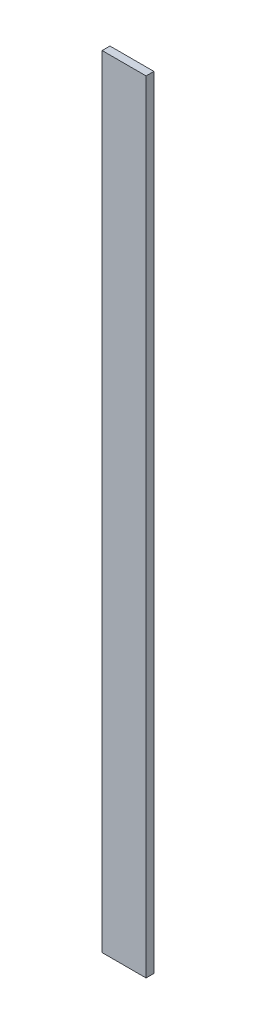
ISO-10303-21;
HEADER;
FILE_DESCRIPTION(('STEP AP214'),'2;1');
FILE_NAME('part.step','',(''),(''),'','','');
FILE_SCHEMA(('AUTOMOTIVE_DESIGN { 1 0 10303 214 1 1 1 1 }'));
ENDSEC;
DATA;
#1=APPLICATION_CONTEXT('core data for automotive mechanical design processes');
#2=APPLICATION_PROTOCOL_DEFINITION('international standard','automotive_design',2000,#1);
#3=PRODUCT_CONTEXT('',#1,'mechanical');
#4=PRODUCT('Part','Part','',(#3));
#5=PRODUCT_RELATED_PRODUCT_CATEGORY('part','',(#4));
#6=PRODUCT_DEFINITION_FORMATION('','',#4);
#7=PRODUCT_DEFINITION_CONTEXT('part definition',#1,'design');
#8=PRODUCT_DEFINITION('design','',#6,#7);
#9=PRODUCT_DEFINITION_SHAPE('','',#8);
#10=(LENGTH_UNIT() NAMED_UNIT(*) SI_UNIT(.MILLI.,.METRE.));
#11=(NAMED_UNIT(*) PLANE_ANGLE_UNIT() SI_UNIT($,.RADIAN.));
#12=(NAMED_UNIT(*) SI_UNIT($,.STERADIAN.) SOLID_ANGLE_UNIT());
#13=UNCERTAINTY_MEASURE_WITH_UNIT(LENGTH_MEASURE(1.E-05),#10,'distance_accuracy_value','');
#14=(GEOMETRIC_REPRESENTATION_CONTEXT(3) GLOBAL_UNCERTAINTY_ASSIGNED_CONTEXT((#13)) GLOBAL_UNIT_ASSIGNED_CONTEXT((#10,
#11,#12)) REPRESENTATION_CONTEXT('',''));
#15=CARTESIAN_POINT('',(0.,0.,0.));
#16=DIRECTION('',(0.,0.,1.));
#17=DIRECTION('',(1.,0.,0.));
#18=AXIS2_PLACEMENT_3D('',#15,#16,#17);
#19=CARTESIAN_POINT('',(-7.14375000000001,168.827893900614,2.54));
#20=DIRECTION('',(1.,0.,0.));
#21=DIRECTION('',(0.,1.,0.));
#22=AXIS2_PLACEMENT_3D('',#19,#20,#21);
#23=PLANE('',#22);
#24=DIRECTION('',(0.,-1.,0.));
#25=VECTOR('',#24,1.);
#26=CARTESIAN_POINT('',(-7.14375000000001,168.827893900614,0.));
#27=LINE('',#26,#25);
#28=CARTESIAN_POINT('',(-7.14375000000001,168.827893900614,0.));
#29=VERTEX_POINT('',#28);
#30=CARTESIAN_POINT('',(-7.14375,-85.1721060993856,0.));
#31=VERTEX_POINT('',#30);
#32=EDGE_CURVE('E99',#29,#31,#27,.T.);
#33=ORIENTED_EDGE('',*,*,#32,.T.);
#34=DIRECTION('',(0.,0.,-1.));
#35=VECTOR('',#34,1.);
#36=CARTESIAN_POINT('',(-7.14375,-85.1721060993856,2.54));
#37=LINE('',#36,#35);
#38=CARTESIAN_POINT('',(-7.14375,-85.1721060993856,2.54));
#39=VERTEX_POINT('',#38);
#40=EDGE_CURVE('E11',#39,#31,#37,.T.);
#41=ORIENTED_EDGE('',*,*,#40,.F.);
#42=DIRECTION('',(0.,-1.,0.));
#43=VECTOR('',#42,1.);
#44=CARTESIAN_POINT('',(-7.14375000000001,168.827893900614,2.54));
#45=LINE('',#44,#43);
#46=CARTESIAN_POINT('',(-7.14375000000001,168.827893900614,2.54));
#47=VERTEX_POINT('',#46);
#48=EDGE_CURVE('E87',#47,#39,#45,.T.);
#49=ORIENTED_EDGE('',*,*,#48,.F.);
#50=DIRECTION('',(0.,0.,-1.));
#51=VECTOR('',#50,1.);
#52=CARTESIAN_POINT('',(-7.14375000000001,168.827893900614,2.54));
#53=LINE('',#52,#51);
#54=EDGE_CURVE('E95',#47,#29,#53,.T.);
#55=ORIENTED_EDGE('',*,*,#54,.T.);
#56=EDGE_LOOP('',(#33,#41,#49,#55));
#57=FACE_BOUND('',#56,.T.);
#58=ADVANCED_FACE('F36',(#57),#23,.F.);
#59=CARTESIAN_POINT('',(-7.14375,-85.1721060993856,2.54));
#60=DIRECTION('',(0.,1.,0.));
#61=DIRECTION('',(0.,0.,1.));
#62=AXIS2_PLACEMENT_3D('',#59,#60,#61);
#63=PLANE('',#62);
#64=DIRECTION('',(1.,0.,0.));
#65=VECTOR('',#64,1.);
#66=CARTESIAN_POINT('',(-7.14375,-85.1721060993856,0.));
#67=LINE('',#66,#65);
#68=CARTESIAN_POINT('',(7.14375,-85.1721060993856,0.));
#69=VERTEX_POINT('',#68);
#70=EDGE_CURVE('E91',#31,#69,#67,.T.);
#71=ORIENTED_EDGE('',*,*,#70,.T.);
#72=DIRECTION('',(0.,0.,-1.));
#73=VECTOR('',#72,1.);
#74=CARTESIAN_POINT('',(7.14375,-85.1721060993856,2.54));
#75=LINE('',#74,#73);
#76=CARTESIAN_POINT('',(7.14375,-85.1721060993856,2.54));
#77=VERTEX_POINT('',#76);
#78=EDGE_CURVE('E44',#77,#69,#75,.T.);
#79=ORIENTED_EDGE('',*,*,#78,.F.);
#80=DIRECTION('',(1.,0.,0.));
#81=VECTOR('',#80,1.);
#82=CARTESIAN_POINT('',(-7.14375,-85.1721060993856,2.54));
#83=LINE('',#82,#81);
#84=EDGE_CURVE('E82',#39,#77,#83,.T.);
#85=ORIENTED_EDGE('',*,*,#84,.F.);
#86=ORIENTED_EDGE('',*,*,#40,.T.);
#87=EDGE_LOOP('',(#71,#79,#85,#86));
#88=FACE_BOUND('',#87,.T.);
#89=ADVANCED_FACE('F90',(#88),#63,.F.);
#90=CARTESIAN_POINT('',(7.14374999999999,168.827893900614,2.54));
#91=DIRECTION('',(-1.,0.,0.));
#92=DIRECTION('',(0.,-1.,0.));
#93=AXIS2_PLACEMENT_3D('',#90,#91,#92);
#94=PLANE('',#93);
#95=DIRECTION('',(0.,1.,0.));
#96=VECTOR('',#95,1.);
#97=CARTESIAN_POINT('',(7.14374999999999,168.827893900614,0.));
#98=LINE('',#97,#96);
#99=CARTESIAN_POINT('',(7.14374999999999,168.827893900614,0.));
#100=VERTEX_POINT('',#99);
#101=EDGE_CURVE('E69',#69,#100,#98,.T.);
#102=ORIENTED_EDGE('',*,*,#101,.T.);
#103=DIRECTION('',(0.,0.,-1.));
#104=VECTOR('',#103,1.);
#105=CARTESIAN_POINT('',(7.14374999999999,168.827893900614,2.54));
#106=LINE('',#105,#104);
#107=CARTESIAN_POINT('',(7.14374999999999,168.827893900614,2.54));
#108=VERTEX_POINT('',#107);
#109=EDGE_CURVE('E92',#108,#100,#106,.T.);
#110=ORIENTED_EDGE('',*,*,#109,.F.);
#111=DIRECTION('',(0.,1.,0.));
#112=VECTOR('',#111,1.);
#113=CARTESIAN_POINT('',(7.14374999999999,168.827893900614,2.54));
#114=LINE('',#113,#112);
#115=EDGE_CURVE('E85',#77,#108,#114,.T.);
#116=ORIENTED_EDGE('',*,*,#115,.F.);
#117=ORIENTED_EDGE('',*,*,#78,.T.);
#118=EDGE_LOOP('',(#102,#110,#116,#117));
#119=FACE_BOUND('',#118,.T.);
#120=ADVANCED_FACE('F93',(#119),#94,.F.);
#121=CARTESIAN_POINT('',(-7.14375000000001,168.827893900614,2.54));
#122=DIRECTION('',(0.,-1.,0.));
#123=DIRECTION('',(0.,0.,-1.));
#124=AXIS2_PLACEMENT_3D('',#121,#122,#123);
#125=PLANE('',#124);
#126=DIRECTION('',(-1.,0.,0.));
#127=VECTOR('',#126,1.);
#128=CARTESIAN_POINT('',(-7.14375000000001,168.827893900614,0.));
#129=LINE('',#128,#127);
#130=EDGE_CURVE('E75',#100,#29,#129,.T.);
#131=ORIENTED_EDGE('',*,*,#130,.T.);
#132=ORIENTED_EDGE('',*,*,#54,.F.);
#133=DIRECTION('',(-1.,0.,0.));
#134=VECTOR('',#133,1.);
#135=CARTESIAN_POINT('',(-7.14375000000001,168.827893900614,2.54));
#136=LINE('',#135,#134);
#137=EDGE_CURVE('E52',#108,#47,#136,.T.);
#138=ORIENTED_EDGE('',*,*,#137,.F.);
#139=ORIENTED_EDGE('',*,*,#109,.T.);
#140=EDGE_LOOP('',(#131,#132,#138,#139));
#141=FACE_BOUND('',#140,.T.);
#142=ADVANCED_FACE('F106',(#141),#125,.F.);
#143=CARTESIAN_POINT('',(0.,0.,2.54));
#144=DIRECTION('',(0.,0.,1.));
#145=DIRECTION('',(1.,0.,0.));
#146=AXIS2_PLACEMENT_3D('',#143,#144,#145);
#147=PLANE('',#146);
#148=ORIENTED_EDGE('',*,*,#48,.T.);
#149=ORIENTED_EDGE('',*,*,#84,.T.);
#150=ORIENTED_EDGE('',*,*,#115,.T.);
#151=ORIENTED_EDGE('',*,*,#137,.T.);
#152=EDGE_LOOP('',(#148,#149,#150,#151));
#153=FACE_BOUND('',#152,.T.);
#154=ADVANCED_FACE('F83',(#153),#147,.T.);
#155=CARTESIAN_POINT('',(0.,0.,0.));
#156=DIRECTION('',(0.,0.,1.));
#157=DIRECTION('',(1.,0.,0.));
#158=AXIS2_PLACEMENT_3D('',#155,#156,#157);
#159=PLANE('',#158);
#160=ORIENTED_EDGE('',*,*,#32,.F.);
#161=ORIENTED_EDGE('',*,*,#130,.F.);
#162=ORIENTED_EDGE('',*,*,#101,.F.);
#163=ORIENTED_EDGE('',*,*,#70,.F.);
#164=EDGE_LOOP('',(#160,#161,#162,#163));
#165=FACE_BOUND('',#164,.T.);
#166=ADVANCED_FACE('F109',(#165),#159,.F.);
#167=CLOSED_SHELL('',(#58,#89,#120,#142,#154,#166));
#168=MANIFOLD_SOLID_BREP('B2',#167);
#169=ADVANCED_BREP_SHAPE_REPRESENTATION('',(#18,#168),#14);
#170=SHAPE_DEFINITION_REPRESENTATION(#9,#169);
ENDSEC;
END-ISO-10303-21;
